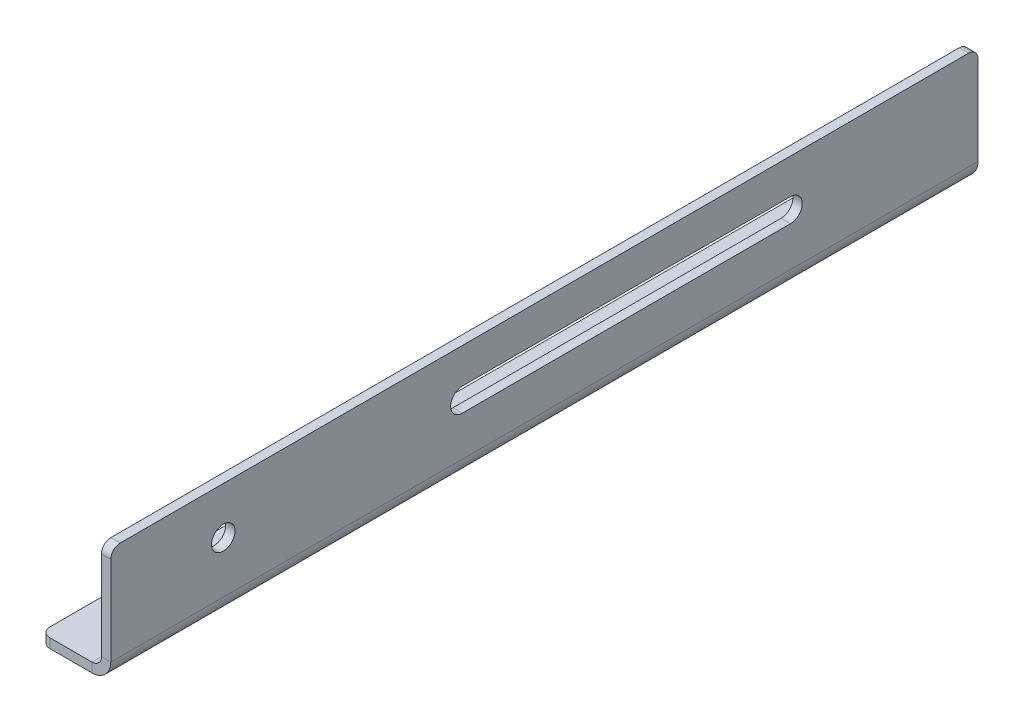
ISO-10303-21;
HEADER;
FILE_DESCRIPTION(('STEP AP214'),'2;1');
FILE_NAME('part.step','',(''),(''),'','','');
FILE_SCHEMA(('AUTOMOTIVE_DESIGN { 1 0 10303 214 1 1 1 1 }'));
ENDSEC;
DATA;
#1=APPLICATION_CONTEXT('core data for automotive mechanical design processes');
#2=APPLICATION_PROTOCOL_DEFINITION('international standard','automotive_design',2000,#1);
#3=PRODUCT_CONTEXT('',#1,'mechanical');
#4=PRODUCT('Part','Part','',(#3));
#5=PRODUCT_RELATED_PRODUCT_CATEGORY('part','',(#4));
#6=PRODUCT_DEFINITION_FORMATION('','',#4);
#7=PRODUCT_DEFINITION_CONTEXT('part definition',#1,'design');
#8=PRODUCT_DEFINITION('design','',#6,#7);
#9=PRODUCT_DEFINITION_SHAPE('','',#8);
#10=(LENGTH_UNIT() NAMED_UNIT(*) SI_UNIT(.MILLI.,.METRE.));
#11=(NAMED_UNIT(*) PLANE_ANGLE_UNIT() SI_UNIT($,.RADIAN.));
#12=(NAMED_UNIT(*) SI_UNIT($,.STERADIAN.) SOLID_ANGLE_UNIT());
#13=UNCERTAINTY_MEASURE_WITH_UNIT(LENGTH_MEASURE(1.E-05),#10,'distance_accuracy_value','');
#14=(GEOMETRIC_REPRESENTATION_CONTEXT(3) GLOBAL_UNCERTAINTY_ASSIGNED_CONTEXT((#13)) GLOBAL_UNIT_ASSIGNED_CONTEXT((#10,
#11,#12)) REPRESENTATION_CONTEXT('',''));
#15=CARTESIAN_POINT('',(0.,0.,0.));
#16=DIRECTION('',(0.,0.,1.));
#17=DIRECTION('',(1.,0.,0.));
#18=AXIS2_PLACEMENT_3D('',#15,#16,#17);
#19=CARTESIAN_POINT('',(0.,4.,0.));
#20=DIRECTION('',(0.,0.,1.));
#21=DIRECTION('',(-1.,0.,0.));
#22=AXIS2_PLACEMENT_3D('',#19,#20,#21);
#23=PLANE('',#22);
#24=DIRECTION('',(1.,0.,0.));
#25=VECTOR('',#24,1.);
#26=CARTESIAN_POINT('',(0.,0.,0.));
#27=LINE('',#26,#25);
#28=CARTESIAN_POINT('',(22.,0.,0.));
#29=VERTEX_POINT('',#28);
#30=CARTESIAN_POINT('',(4.,0.,0.));
#31=VERTEX_POINT('',#30);
#32=EDGE_CURVE('E238',#29,#31,#27,.F.);
#33=ORIENTED_EDGE('',*,*,#32,.T.);
#34=DIRECTION('',(0.,1.,0.));
#35=VECTOR('',#34,1.);
#36=CARTESIAN_POINT('',(4.,4.,0.));
#37=LINE('',#36,#35);
#38=CARTESIAN_POINT('',(4.,4.,0.));
#39=VERTEX_POINT('',#38);
#40=EDGE_CURVE('E277',#31,#39,#37,.T.);
#41=ORIENTED_EDGE('',*,*,#40,.T.);
#42=DIRECTION('',(-1.,0.,0.));
#43=VECTOR('',#42,1.);
#44=CARTESIAN_POINT('',(0.,4.,0.));
#45=LINE('',#44,#43);
#46=CARTESIAN_POINT('',(22.,4.,0.));
#47=VERTEX_POINT('',#46);
#48=EDGE_CURVE('E388',#47,#39,#45,.T.);
#49=ORIENTED_EDGE('',*,*,#48,.F.);
#50=DIRECTION('',(0.,1.,0.));
#51=VECTOR('',#50,1.);
#52=CARTESIAN_POINT('',(22.,4.,0.));
#53=LINE('',#52,#51);
#54=EDGE_CURVE('E258',#29,#47,#53,.T.);
#55=ORIENTED_EDGE('',*,*,#54,.F.);
#56=EDGE_LOOP('',(#33,#41,#49,#55));
#57=FACE_BOUND('',#56,.T.);
#58=ADVANCED_FACE('F37',(#57),#23,.F.);
#59=CARTESIAN_POINT('',(0.,4.,370.));
#60=DIRECTION('',(-1.,0.,0.));
#61=DIRECTION('',(0.,0.,-1.));
#62=AXIS2_PLACEMENT_3D('',#59,#60,#61);
#63=PLANE('',#62);
#64=DIRECTION('',(0.,0.,-1.));
#65=VECTOR('',#64,1.);
#66=CARTESIAN_POINT('',(0.,4.,370.));
#67=LINE('',#66,#65);
#68=CARTESIAN_POINT('',(0.,4.,366.));
#69=VERTEX_POINT('',#68);
#70=CARTESIAN_POINT('',(0.,4.,4.));
#71=VERTEX_POINT('',#70);
#72=EDGE_CURVE('E393',#69,#71,#67,.T.);
#73=ORIENTED_EDGE('',*,*,#72,.T.);
#74=DIRECTION('',(0.,-1.,0.));
#75=VECTOR('',#74,1.);
#76=CARTESIAN_POINT('',(0.,4.,4.));
#77=LINE('',#76,#75);
#78=CARTESIAN_POINT('',(0.,0.,4.));
#79=VERTEX_POINT('',#78);
#80=EDGE_CURVE('E58',#71,#79,#77,.T.);
#81=ORIENTED_EDGE('',*,*,#80,.T.);
#82=DIRECTION('',(0.,0.,-1.));
#83=VECTOR('',#82,1.);
#84=CARTESIAN_POINT('',(0.,0.,370.));
#85=LINE('',#84,#83);
#86=CARTESIAN_POINT('',(0.,0.,366.));
#87=VERTEX_POINT('',#86);
#88=EDGE_CURVE('E236',#87,#79,#85,.T.);
#89=ORIENTED_EDGE('',*,*,#88,.F.);
#90=DIRECTION('',(0.,1.,0.));
#91=VECTOR('',#90,1.);
#92=CARTESIAN_POINT('',(0.,4.,366.));
#93=LINE('',#92,#91);
#94=EDGE_CURVE('E284',#87,#69,#93,.T.);
#95=ORIENTED_EDGE('',*,*,#94,.T.);
#96=EDGE_LOOP('',(#73,#81,#89,#95));
#97=FACE_BOUND('',#96,.T.);
#98=ADVANCED_FACE('F346',(#97),#63,.T.);
#99=CARTESIAN_POINT('',(0.,4.,370.));
#100=DIRECTION('',(0.,0.,1.));
#101=DIRECTION('',(-1.,0.,0.));
#102=AXIS2_PLACEMENT_3D('',#99,#100,#101);
#103=PLANE('',#102);
#104=DIRECTION('',(-1.,0.,0.));
#105=VECTOR('',#104,1.);
#106=CARTESIAN_POINT('',(0.,4.,370.));
#107=LINE('',#106,#105);
#108=CARTESIAN_POINT('',(22.,4.,370.));
#109=VERTEX_POINT('',#108);
#110=CARTESIAN_POINT('',(4.,4.,370.));
#111=VERTEX_POINT('',#110);
#112=EDGE_CURVE('E395',#109,#111,#107,.T.);
#113=ORIENTED_EDGE('',*,*,#112,.T.);
#114=DIRECTION('',(0.,1.,0.));
#115=VECTOR('',#114,1.);
#116=CARTESIAN_POINT('',(4.,4.,370.));
#117=LINE('',#116,#115);
#118=CARTESIAN_POINT('',(4.,0.,370.));
#119=VERTEX_POINT('',#118);
#120=EDGE_CURVE('E11',#111,#119,#117,.F.);
#121=ORIENTED_EDGE('',*,*,#120,.T.);
#122=DIRECTION('',(1.,0.,0.));
#123=VECTOR('',#122,1.);
#124=CARTESIAN_POINT('',(0.,0.,370.));
#125=LINE('',#124,#123);
#126=CARTESIAN_POINT('',(22.,0.,370.));
#127=VERTEX_POINT('',#126);
#128=EDGE_CURVE('E214',#127,#119,#125,.F.);
#129=ORIENTED_EDGE('',*,*,#128,.F.);
#130=DIRECTION('',(0.,1.,0.));
#131=VECTOR('',#130,1.);
#132=CARTESIAN_POINT('',(22.,4.,370.));
#133=LINE('',#132,#131);
#134=EDGE_CURVE('E256',#127,#109,#133,.T.);
#135=ORIENTED_EDGE('',*,*,#134,.T.);
#136=EDGE_LOOP('',(#113,#121,#129,#135));
#137=FACE_BOUND('',#136,.T.);
#138=ADVANCED_FACE('F352',(#137),#103,.T.);
#139=CARTESIAN_POINT('',(22.,8.,370.));
#140=DIRECTION('',(0.,0.,1.));
#141=DIRECTION('',(1.,0.,0.));
#142=AXIS2_PLACEMENT_3D('',#139,#140,#141);
#143=PLANE('',#142);
#144=ORIENTED_EDGE('',*,*,#134,.F.);
#145=CARTESIAN_POINT('',(22.,8.,370.));
#146=DIRECTION('',(0.,0.,1.));
#147=DIRECTION('',(1.,0.,0.));
#148=AXIS2_PLACEMENT_3D('',#145,#146,#147);
#149=CIRCLE('',#148,8.);
#150=CARTESIAN_POINT('',(30.,8.,370.));
#151=VERTEX_POINT('',#150);
#152=EDGE_CURVE('E230',#127,#151,#149,.T.);
#153=ORIENTED_EDGE('',*,*,#152,.T.);
#154=DIRECTION('',(-1.,0.,0.));
#155=VECTOR('',#154,1.);
#156=CARTESIAN_POINT('',(26.,8.,370.));
#157=LINE('',#156,#155);
#158=CARTESIAN_POINT('',(26.,8.,370.));
#159=VERTEX_POINT('',#158);
#160=EDGE_CURVE('E253',#151,#159,#157,.T.);
#161=ORIENTED_EDGE('',*,*,#160,.T.);
#162=CARTESIAN_POINT('',(22.,8.,370.));
#163=DIRECTION('',(0.,0.,-1.));
#164=DIRECTION('',(-1.,0.,0.));
#165=AXIS2_PLACEMENT_3D('',#162,#163,#164);
#166=CIRCLE('',#165,4.);
#167=EDGE_CURVE('E200',#109,#159,#166,.F.);
#168=ORIENTED_EDGE('',*,*,#167,.F.);
#169=EDGE_LOOP('',(#144,#153,#161,#168));
#170=FACE_BOUND('',#169,.T.);
#171=ADVANCED_FACE('F310',(#170),#143,.T.);
#172=CARTESIAN_POINT('',(26.,4.,370.));
#173=DIRECTION('',(0.,0.,1.));
#174=DIRECTION('',(0.,-1.,0.));
#175=AXIS2_PLACEMENT_3D('',#172,#173,#174);
#176=PLANE('',#175);
#177=DIRECTION('',(0.,1.,0.));
#178=VECTOR('',#177,1.);
#179=CARTESIAN_POINT('',(30.,4.,370.));
#180=LINE('',#179,#178);
#181=CARTESIAN_POINT('',(30.,46.,370.));
#182=VERTEX_POINT('',#181);
#183=EDGE_CURVE('E226',#182,#151,#180,.F.);
#184=ORIENTED_EDGE('',*,*,#183,.F.);
#185=DIRECTION('',(1.,0.,0.));
#186=VECTOR('',#185,1.);
#187=CARTESIAN_POINT('',(26.,46.,370.));
#188=LINE('',#187,#186);
#189=CARTESIAN_POINT('',(26.,46.,370.));
#190=VERTEX_POINT('',#189);
#191=EDGE_CURVE('E45',#182,#190,#188,.F.);
#192=ORIENTED_EDGE('',*,*,#191,.T.);
#193=DIRECTION('',(0.,-1.,0.));
#194=VECTOR('',#193,1.);
#195=CARTESIAN_POINT('',(26.,4.,370.));
#196=LINE('',#195,#194);
#197=EDGE_CURVE('E187',#190,#159,#196,.T.);
#198=ORIENTED_EDGE('',*,*,#197,.T.);
#199=ORIENTED_EDGE('',*,*,#160,.F.);
#200=EDGE_LOOP('',(#184,#192,#198,#199));
#201=FACE_BOUND('',#200,.T.);
#202=ADVANCED_FACE('F296',(#201),#176,.T.);
#203=CARTESIAN_POINT('',(26.,50.,370.));
#204=DIRECTION('',(0.,-1.,0.));
#205=DIRECTION('',(0.,0.,-1.));
#206=AXIS2_PLACEMENT_3D('',#203,#204,#205);
#207=PLANE('',#206);
#208=DIRECTION('',(0.,0.,-1.));
#209=VECTOR('',#208,1.);
#210=CARTESIAN_POINT('',(30.,50.,370.));
#211=LINE('',#210,#209);
#212=CARTESIAN_POINT('',(30.,50.,366.));
#213=VERTEX_POINT('',#212);
#214=CARTESIAN_POINT('',(30.,50.,4.));
#215=VERTEX_POINT('',#214);
#216=EDGE_CURVE('E210',#213,#215,#211,.T.);
#217=ORIENTED_EDGE('',*,*,#216,.T.);
#218=DIRECTION('',(1.,0.,0.));
#219=VECTOR('',#218,1.);
#220=CARTESIAN_POINT('',(26.,50.,4.));
#221=LINE('',#220,#219);
#222=CARTESIAN_POINT('',(26.,50.,4.));
#223=VERTEX_POINT('',#222);
#224=EDGE_CURVE('E264',#215,#223,#221,.F.);
#225=ORIENTED_EDGE('',*,*,#224,.T.);
#226=DIRECTION('',(0.,0.,-1.));
#227=VECTOR('',#226,1.);
#228=CARTESIAN_POINT('',(26.,50.,370.));
#229=LINE('',#228,#227);
#230=CARTESIAN_POINT('',(26.,50.,366.));
#231=VERTEX_POINT('',#230);
#232=EDGE_CURVE('E189',#231,#223,#229,.T.);
#233=ORIENTED_EDGE('',*,*,#232,.F.);
#234=DIRECTION('',(-1.,0.,0.));
#235=VECTOR('',#234,1.);
#236=CARTESIAN_POINT('',(26.,50.,366.));
#237=LINE('',#236,#235);
#238=EDGE_CURVE('E260',#231,#213,#237,.F.);
#239=ORIENTED_EDGE('',*,*,#238,.T.);
#240=EDGE_LOOP('',(#217,#225,#233,#239));
#241=FACE_BOUND('',#240,.T.);
#242=ADVANCED_FACE('F325',(#241),#207,.F.);
#243=CARTESIAN_POINT('',(26.,4.,0.));
#244=DIRECTION('',(0.,0.,1.));
#245=DIRECTION('',(0.,-1.,0.));
#246=AXIS2_PLACEMENT_3D('',#243,#244,#245);
#247=PLANE('',#246);
#248=DIRECTION('',(0.,-1.,0.));
#249=VECTOR('',#248,1.);
#250=CARTESIAN_POINT('',(26.,4.,0.));
#251=LINE('',#250,#249);
#252=CARTESIAN_POINT('',(26.,46.,0.));
#253=VERTEX_POINT('',#252);
#254=CARTESIAN_POINT('',(26.,8.,0.));
#255=VERTEX_POINT('',#254);
#256=EDGE_CURVE('E185',#253,#255,#251,.T.);
#257=ORIENTED_EDGE('',*,*,#256,.F.);
#258=DIRECTION('',(1.,0.,0.));
#259=VECTOR('',#258,1.);
#260=CARTESIAN_POINT('',(26.,46.,0.));
#261=LINE('',#260,#259);
#262=CARTESIAN_POINT('',(30.,46.,0.));
#263=VERTEX_POINT('',#262);
#264=EDGE_CURVE('E271',#253,#263,#261,.T.);
#265=ORIENTED_EDGE('',*,*,#264,.T.);
#266=DIRECTION('',(0.,1.,0.));
#267=VECTOR('',#266,1.);
#268=CARTESIAN_POINT('',(30.,4.,0.));
#269=LINE('',#268,#267);
#270=CARTESIAN_POINT('',(30.,8.,0.));
#271=VERTEX_POINT('',#270);
#272=EDGE_CURVE('E220',#263,#271,#269,.F.);
#273=ORIENTED_EDGE('',*,*,#272,.T.);
#274=DIRECTION('',(-1.,0.,0.));
#275=VECTOR('',#274,1.);
#276=CARTESIAN_POINT('',(26.,8.,0.));
#277=LINE('',#276,#275);
#278=EDGE_CURVE('E251',#271,#255,#277,.T.);
#279=ORIENTED_EDGE('',*,*,#278,.T.);
#280=EDGE_LOOP('',(#257,#265,#273,#279));
#281=FACE_BOUND('',#280,.T.);
#282=ADVANCED_FACE('F330',(#281),#247,.F.);
#283=CARTESIAN_POINT('',(26.,35.,80.));
#284=DIRECTION('',(0.,-1.,0.));
#285=DIRECTION('',(0.,0.,-1.));
#286=AXIS2_PLACEMENT_3D('',#283,#284,#285);
#287=PLANE('',#286);
#288=DIRECTION('',(-1.,0.,0.));
#289=VECTOR('',#288,1.);
#290=CARTESIAN_POINT('',(26.,35.,80.));
#291=LINE('',#290,#289);
#292=CARTESIAN_POINT('',(30.,35.,80.));
#293=VERTEX_POINT('',#292);
#294=CARTESIAN_POINT('',(26.,35.,80.));
#295=VERTEX_POINT('',#294);
#296=EDGE_CURVE('E178',#293,#295,#291,.T.);
#297=ORIENTED_EDGE('',*,*,#296,.F.);
#298=DIRECTION('',(0.,0.,-1.));
#299=VECTOR('',#298,1.);
#300=CARTESIAN_POINT('',(30.,35.,370.));
#301=LINE('',#300,#299);
#302=CARTESIAN_POINT('',(30.,35.,220.));
#303=VERTEX_POINT('',#302);
#304=EDGE_CURVE('E221',#303,#293,#301,.T.);
#305=ORIENTED_EDGE('',*,*,#304,.F.);
#306=DIRECTION('',(-1.,0.,0.));
#307=VECTOR('',#306,1.);
#308=CARTESIAN_POINT('',(26.,35.,220.));
#309=LINE('',#308,#307);
#310=CARTESIAN_POINT('',(26.,35.,220.));
#311=VERTEX_POINT('',#310);
#312=EDGE_CURVE('E249',#303,#311,#309,.T.);
#313=ORIENTED_EDGE('',*,*,#312,.T.);
#314=DIRECTION('',(0.,0.,-1.));
#315=VECTOR('',#314,1.);
#316=CARTESIAN_POINT('',(26.,35.,80.));
#317=LINE('',#316,#315);
#318=EDGE_CURVE('E179',#311,#295,#317,.T.);
#319=ORIENTED_EDGE('',*,*,#318,.T.);
#320=EDGE_LOOP('',(#297,#305,#313,#319));
#321=FACE_BOUND('',#320,.T.);
#322=ADVANCED_FACE('F414',(#321),#287,.T.);
#323=CARTESIAN_POINT('',(26.,30.,220.));
#324=DIRECTION('',(1.,0.,0.));
#325=DIRECTION('',(0.,0.,-1.));
#326=AXIS2_PLACEMENT_3D('',#323,#324,#325);
#327=CYLINDRICAL_SURFACE('',#326,5.);
#328=ORIENTED_EDGE('',*,*,#312,.F.);
#329=CARTESIAN_POINT('',(30.,30.,220.));
#330=DIRECTION('',(-1.,0.,0.));
#331=DIRECTION('',(0.,0.,1.));
#332=AXIS2_PLACEMENT_3D('',#329,#330,#331);
#333=CIRCLE('',#332,5.);
#334=CARTESIAN_POINT('',(30.,25.,220.));
#335=VERTEX_POINT('',#334);
#336=EDGE_CURVE('E217',#335,#303,#333,.T.);
#337=ORIENTED_EDGE('',*,*,#336,.F.);
#338=DIRECTION('',(-1.,0.,0.));
#339=VECTOR('',#338,1.);
#340=CARTESIAN_POINT('',(26.,25.,220.));
#341=LINE('',#340,#339);
#342=CARTESIAN_POINT('',(26.,25.,220.));
#343=VERTEX_POINT('',#342);
#344=EDGE_CURVE('E163',#335,#343,#341,.T.);
#345=ORIENTED_EDGE('',*,*,#344,.T.);
#346=CARTESIAN_POINT('',(26.,30.,220.));
#347=DIRECTION('',(-1.,0.,0.));
#348=DIRECTION('',(0.,0.,1.));
#349=AXIS2_PLACEMENT_3D('',#346,#347,#348);
#350=CIRCLE('',#349,5.);
#351=EDGE_CURVE('E174',#343,#311,#350,.T.);
#352=ORIENTED_EDGE('',*,*,#351,.T.);
#353=EDGE_LOOP('',(#328,#337,#345,#352));
#354=FACE_BOUND('',#353,.T.);
#355=ADVANCED_FACE('F411',(#354),#327,.F.);
#356=CARTESIAN_POINT('',(26.,25.,80.));
#357=DIRECTION('',(0.,1.,0.));
#358=DIRECTION('',(0.,0.,1.));
#359=AXIS2_PLACEMENT_3D('',#356,#357,#358);
#360=PLANE('',#359);
#361=ORIENTED_EDGE('',*,*,#344,.F.);
#362=DIRECTION('',(0.,0.,-1.));
#363=VECTOR('',#362,1.);
#364=CARTESIAN_POINT('',(30.,25.,370.));
#365=LINE('',#364,#363);
#366=CARTESIAN_POINT('',(30.,25.,80.));
#367=VERTEX_POINT('',#366);
#368=EDGE_CURVE('E158',#367,#335,#365,.F.);
#369=ORIENTED_EDGE('',*,*,#368,.F.);
#370=DIRECTION('',(-1.,0.,0.));
#371=VECTOR('',#370,1.);
#372=CARTESIAN_POINT('',(26.,25.,80.));
#373=LINE('',#372,#371);
#374=CARTESIAN_POINT('',(26.,25.,80.));
#375=VERTEX_POINT('',#374);
#376=EDGE_CURVE('E152',#367,#375,#373,.T.);
#377=ORIENTED_EDGE('',*,*,#376,.T.);
#378=DIRECTION('',(0.,0.,1.));
#379=VECTOR('',#378,1.);
#380=CARTESIAN_POINT('',(26.,25.,80.));
#381=LINE('',#380,#379);
#382=EDGE_CURVE('E155',#375,#343,#381,.T.);
#383=ORIENTED_EDGE('',*,*,#382,.T.);
#384=EDGE_LOOP('',(#361,#369,#377,#383));
#385=FACE_BOUND('',#384,.T.);
#386=ADVANCED_FACE('F154',(#385),#360,.T.);
#387=CARTESIAN_POINT('',(8.2,4.,27.7));
#388=DIRECTION('',(0.,-1.,0.));
#389=DIRECTION('',(0.,0.,-1.));
#390=AXIS2_PLACEMENT_3D('',#387,#388,#389);
#391=CYLINDRICAL_SURFACE('',#390,2.5);
#392=CARTESIAN_POINT('',(8.2,4.,27.7));
#393=DIRECTION('',(0.,-1.,0.));
#394=DIRECTION('',(0.,0.,-1.));
#395=AXIS2_PLACEMENT_3D('',#392,#393,#394);
#396=CIRCLE('',#395,2.5);
#397=CARTESIAN_POINT('',(8.2,4.,25.2));
#398=VERTEX_POINT('',#397);
#399=EDGE_CURVE('E204',#398,#398,#396,.T.);
#400=ORIENTED_EDGE('',*,*,#399,.F.);
#401=EDGE_LOOP('',(#400));
#402=FACE_BOUND('',#401,.T.);
#403=CARTESIAN_POINT('',(8.2,0.,27.7));
#404=DIRECTION('',(0.,-1.,0.));
#405=DIRECTION('',(0.,0.,-1.));
#406=AXIS2_PLACEMENT_3D('',#403,#404,#405);
#407=CIRCLE('',#406,2.5);
#408=CARTESIAN_POINT('',(8.2,0.,25.2));
#409=VERTEX_POINT('',#408);
#410=EDGE_CURVE('E233',#409,#409,#407,.T.);
#411=ORIENTED_EDGE('',*,*,#410,.T.);
#412=EDGE_LOOP('',(#411));
#413=FACE_BOUND('',#412,.T.);
#414=ADVANCED_FACE('F360',(#402,#413),#391,.F.);
#415=CARTESIAN_POINT('',(8.2,4.,342.3));
#416=DIRECTION('',(0.,-1.,0.));
#417=DIRECTION('',(0.,0.,-1.));
#418=AXIS2_PLACEMENT_3D('',#415,#416,#417);
#419=CYLINDRICAL_SURFACE('',#418,2.5);
#420=CARTESIAN_POINT('',(8.2,4.,342.3));
#421=DIRECTION('',(0.,-1.,0.));
#422=DIRECTION('',(0.,0.,-1.));
#423=AXIS2_PLACEMENT_3D('',#420,#421,#422);
#424=CIRCLE('',#423,2.5);
#425=CARTESIAN_POINT('',(8.2,4.,339.8));
#426=VERTEX_POINT('',#425);
#427=EDGE_CURVE('E375',#426,#426,#424,.T.);
#428=ORIENTED_EDGE('',*,*,#427,.F.);
#429=EDGE_LOOP('',(#428));
#430=FACE_BOUND('',#429,.T.);
#431=CARTESIAN_POINT('',(8.2,0.,342.3));
#432=DIRECTION('',(0.,-1.,0.));
#433=DIRECTION('',(0.,0.,-1.));
#434=AXIS2_PLACEMENT_3D('',#431,#432,#433);
#435=CIRCLE('',#434,2.5);
#436=CARTESIAN_POINT('',(8.2,0.,339.8));
#437=VERTEX_POINT('',#436);
#438=EDGE_CURVE('E241',#437,#437,#435,.T.);
#439=ORIENTED_EDGE('',*,*,#438,.T.);
#440=EDGE_LOOP('',(#439));
#441=FACE_BOUND('',#440,.T.);
#442=ADVANCED_FACE('F362',(#430,#441),#419,.F.);
#443=CARTESIAN_POINT('',(26.,30.,322.));
#444=DIRECTION('',(1.,0.,0.));
#445=DIRECTION('',(0.,0.,-1.));
#446=AXIS2_PLACEMENT_3D('',#443,#444,#445);
#447=CYLINDRICAL_SURFACE('',#446,4.99999999999999);
#448=CARTESIAN_POINT('',(26.,30.,322.));
#449=DIRECTION('',(1.,0.,0.));
#450=DIRECTION('',(0.,0.,-1.));
#451=AXIS2_PLACEMENT_3D('',#448,#449,#450);
#452=CIRCLE('',#451,4.99999999999999);
#453=CARTESIAN_POINT('',(26.,30.,317.));
#454=VERTEX_POINT('',#453);
#455=EDGE_CURVE('E175',#454,#454,#452,.T.);
#456=ORIENTED_EDGE('',*,*,#455,.F.);
#457=EDGE_LOOP('',(#456));
#458=FACE_BOUND('',#457,.T.);
#459=CARTESIAN_POINT('',(30.,30.,322.));
#460=DIRECTION('',(1.,0.,0.));
#461=DIRECTION('',(0.,0.,-1.));
#462=AXIS2_PLACEMENT_3D('',#459,#460,#461);
#463=CIRCLE('',#462,4.99999999999999);
#464=CARTESIAN_POINT('',(30.,30.,317.));
#465=VERTEX_POINT('',#464);
#466=EDGE_CURVE('E211',#465,#465,#463,.T.);
#467=ORIENTED_EDGE('',*,*,#466,.T.);
#468=EDGE_LOOP('',(#467));
#469=FACE_BOUND('',#468,.T.);
#470=ADVANCED_FACE('F365',(#458,#469),#447,.F.);
#471=CARTESIAN_POINT('',(26.,30.,80.));
#472=DIRECTION('',(1.,0.,0.));
#473=DIRECTION('',(0.,0.,-1.));
#474=AXIS2_PLACEMENT_3D('',#471,#472,#473);
#475=CYLINDRICAL_SURFACE('',#474,5.);
#476=CARTESIAN_POINT('',(30.,30.,80.));
#477=DIRECTION('',(-1.,0.,0.));
#478=DIRECTION('',(0.,0.,1.));
#479=AXIS2_PLACEMENT_3D('',#476,#477,#478);
#480=CIRCLE('',#479,5.);
#481=EDGE_CURVE('E216',#293,#367,#480,.T.);
#482=ORIENTED_EDGE('',*,*,#481,.F.);
#483=ORIENTED_EDGE('',*,*,#296,.T.);
#484=CARTESIAN_POINT('',(26.,30.,80.));
#485=DIRECTION('',(-1.,0.,0.));
#486=DIRECTION('',(0.,0.,1.));
#487=AXIS2_PLACEMENT_3D('',#484,#485,#486);
#488=CIRCLE('',#487,5.);
#489=EDGE_CURVE('E171',#295,#375,#488,.T.);
#490=ORIENTED_EDGE('',*,*,#489,.T.);
#491=ORIENTED_EDGE('',*,*,#376,.F.);
#492=EDGE_LOOP('',(#482,#483,#490,#491));
#493=FACE_BOUND('',#492,.T.);
#494=ADVANCED_FACE('F177',(#493),#475,.F.);
#495=CARTESIAN_POINT('',(22.,8.,0.));
#496=DIRECTION('',(0.,0.,-1.));
#497=DIRECTION('',(-1.,0.,0.));
#498=AXIS2_PLACEMENT_3D('',#495,#496,#497);
#499=PLANE('',#498);
#500=CARTESIAN_POINT('',(22.,8.,0.));
#501=DIRECTION('',(0.,0.,1.));
#502=DIRECTION('',(1.,0.,0.));
#503=AXIS2_PLACEMENT_3D('',#500,#501,#502);
#504=CIRCLE('',#503,8.);
#505=EDGE_CURVE('E234',#271,#29,#504,.F.);
#506=ORIENTED_EDGE('',*,*,#505,.T.);
#507=ORIENTED_EDGE('',*,*,#54,.T.);
#508=CARTESIAN_POINT('',(22.,8.,0.));
#509=DIRECTION('',(0.,0.,1.));
#510=DIRECTION('',(1.,0.,0.));
#511=AXIS2_PLACEMENT_3D('',#508,#509,#510);
#512=CIRCLE('',#511,4.);
#513=EDGE_CURVE('E197',#255,#47,#512,.F.);
#514=ORIENTED_EDGE('',*,*,#513,.F.);
#515=ORIENTED_EDGE('',*,*,#278,.F.);
#516=EDGE_LOOP('',(#506,#507,#514,#515));
#517=FACE_BOUND('',#516,.T.);
#518=ADVANCED_FACE('F356',(#517),#499,.T.);
#519=CARTESIAN_POINT('',(26.,4.,370.));
#520=DIRECTION('',(1.,0.,0.));
#521=DIRECTION('',(0.,0.,-1.));
#522=AXIS2_PLACEMENT_3D('',#519,#520,#521);
#523=PLANE('',#522);
#524=ORIENTED_EDGE('',*,*,#455,.T.);
#525=EDGE_LOOP('',(#524));
#526=FACE_BOUND('',#525,.T.);
#527=ORIENTED_EDGE('',*,*,#382,.F.);
#528=ORIENTED_EDGE('',*,*,#489,.F.);
#529=ORIENTED_EDGE('',*,*,#318,.F.);
#530=ORIENTED_EDGE('',*,*,#351,.F.);
#531=EDGE_LOOP('',(#527,#528,#529,#530));
#532=FACE_BOUND('',#531,.T.);
#533=ORIENTED_EDGE('',*,*,#232,.T.);
#534=CARTESIAN_POINT('',(26.,46.,4.));
#535=DIRECTION('',(1.,0.,0.));
#536=DIRECTION('',(0.,0.,-1.));
#537=AXIS2_PLACEMENT_3D('',#534,#535,#536);
#538=CIRCLE('',#537,4.);
#539=EDGE_CURVE('E269',#223,#253,#538,.F.);
#540=ORIENTED_EDGE('',*,*,#539,.T.);
#541=ORIENTED_EDGE('',*,*,#256,.T.);
#542=DIRECTION('',(0.,0.,-1.));
#543=VECTOR('',#542,1.);
#544=CARTESIAN_POINT('',(26.,8.,370.));
#545=LINE('',#544,#543);
#546=EDGE_CURVE('E164',#255,#159,#545,.F.);
#547=ORIENTED_EDGE('',*,*,#546,.T.);
#548=ORIENTED_EDGE('',*,*,#197,.F.);
#549=CARTESIAN_POINT('',(26.,46.,366.));
#550=DIRECTION('',(1.,0.,0.));
#551=DIRECTION('',(0.,0.,-1.));
#552=AXIS2_PLACEMENT_3D('',#549,#550,#551);
#553=CIRCLE('',#552,4.);
#554=EDGE_CURVE('E267',#190,#231,#553,.F.);
#555=ORIENTED_EDGE('',*,*,#554,.T.);
#556=EDGE_LOOP('',(#533,#540,#541,#547,#548,#555));
#557=FACE_BOUND('',#556,.T.);
#558=ADVANCED_FACE('F168',(#526,#532,#557),#523,.F.);
#559=CARTESIAN_POINT('',(0.,4.,370.));
#560=DIRECTION('',(0.,-1.,0.));
#561=DIRECTION('',(0.,0.,-1.));
#562=AXIS2_PLACEMENT_3D('',#559,#560,#561);
#563=PLANE('',#562);
#564=ORIENTED_EDGE('',*,*,#399,.T.);
#565=EDGE_LOOP('',(#564));
#566=FACE_BOUND('',#565,.T.);
#567=ORIENTED_EDGE('',*,*,#427,.T.);
#568=EDGE_LOOP('',(#567));
#569=FACE_BOUND('',#568,.T.);
#570=ORIENTED_EDGE('',*,*,#48,.T.);
#571=CARTESIAN_POINT('',(4.,4.,4.));
#572=DIRECTION('',(0.,-1.,0.));
#573=DIRECTION('',(0.,0.,-1.));
#574=AXIS2_PLACEMENT_3D('',#571,#572,#573);
#575=CIRCLE('',#574,4.);
#576=EDGE_CURVE('E282',#39,#71,#575,.F.);
#577=ORIENTED_EDGE('',*,*,#576,.T.);
#578=ORIENTED_EDGE('',*,*,#72,.F.);
#579=CARTESIAN_POINT('',(4.,4.,366.));
#580=DIRECTION('',(0.,-1.,0.));
#581=DIRECTION('',(0.,0.,-1.));
#582=AXIS2_PLACEMENT_3D('',#579,#580,#581);
#583=CIRCLE('',#582,4.);
#584=EDGE_CURVE('E280',#69,#111,#583,.F.);
#585=ORIENTED_EDGE('',*,*,#584,.T.);
#586=ORIENTED_EDGE('',*,*,#112,.F.);
#587=DIRECTION('',(0.,0.,-1.));
#588=VECTOR('',#587,1.);
#589=CARTESIAN_POINT('',(22.,4.,0.));
#590=LINE('',#589,#588);
#591=EDGE_CURVE('E192',#109,#47,#590,.T.);
#592=ORIENTED_EDGE('',*,*,#591,.T.);
#593=EDGE_LOOP('',(#570,#577,#578,#585,#586,#592));
#594=FACE_BOUND('',#593,.T.);
#595=ADVANCED_FACE('F390',(#566,#569,#594),#563,.F.);
#596=CARTESIAN_POINT('',(22.,8.,370.));
#597=DIRECTION('',(0.,0.,1.));
#598=DIRECTION('',(1.,0.,0.));
#599=AXIS2_PLACEMENT_3D('',#596,#597,#598);
#600=CYLINDRICAL_SURFACE('',#599,4.);
#601=ORIENTED_EDGE('',*,*,#167,.T.);
#602=ORIENTED_EDGE('',*,*,#546,.F.);
#603=ORIENTED_EDGE('',*,*,#513,.T.);
#604=ORIENTED_EDGE('',*,*,#591,.F.);
#605=EDGE_LOOP('',(#601,#602,#603,#604));
#606=FACE_BOUND('',#605,.T.);
#607=ADVANCED_FACE('F304',(#606),#600,.F.);
#608=CARTESIAN_POINT('',(30.,4.,370.));
#609=DIRECTION('',(1.,0.,0.));
#610=DIRECTION('',(0.,0.,-1.));
#611=AXIS2_PLACEMENT_3D('',#608,#609,#610);
#612=PLANE('',#611);
#613=ORIENTED_EDGE('',*,*,#466,.F.);
#614=EDGE_LOOP('',(#613));
#615=FACE_BOUND('',#614,.T.);
#616=ORIENTED_EDGE('',*,*,#368,.T.);
#617=ORIENTED_EDGE('',*,*,#336,.T.);
#618=ORIENTED_EDGE('',*,*,#304,.T.);
#619=ORIENTED_EDGE('',*,*,#481,.T.);
#620=EDGE_LOOP('',(#616,#617,#618,#619));
#621=FACE_BOUND('',#620,.T.);
#622=ORIENTED_EDGE('',*,*,#272,.F.);
#623=CARTESIAN_POINT('',(30.,46.,4.));
#624=DIRECTION('',(1.,0.,0.));
#625=DIRECTION('',(0.,0.,-1.));
#626=AXIS2_PLACEMENT_3D('',#623,#624,#625);
#627=CIRCLE('',#626,4.);
#628=EDGE_CURVE('E275',#263,#215,#627,.T.);
#629=ORIENTED_EDGE('',*,*,#628,.T.);
#630=ORIENTED_EDGE('',*,*,#216,.F.);
#631=CARTESIAN_POINT('',(30.,46.,366.));
#632=DIRECTION('',(1.,0.,0.));
#633=DIRECTION('',(0.,0.,-1.));
#634=AXIS2_PLACEMENT_3D('',#631,#632,#633);
#635=CIRCLE('',#634,4.);
#636=EDGE_CURVE('E273',#213,#182,#635,.T.);
#637=ORIENTED_EDGE('',*,*,#636,.T.);
#638=ORIENTED_EDGE('',*,*,#183,.T.);
#639=DIRECTION('',(0.,0.,-1.));
#640=VECTOR('',#639,1.);
#641=CARTESIAN_POINT('',(30.,8.,370.));
#642=LINE('',#641,#640);
#643=EDGE_CURVE('E201',#271,#151,#642,.F.);
#644=ORIENTED_EDGE('',*,*,#643,.F.);
#645=EDGE_LOOP('',(#622,#629,#630,#637,#638,#644));
#646=FACE_BOUND('',#645,.T.);
#647=ADVANCED_FACE('F319',(#615,#621,#646),#612,.T.);
#648=CARTESIAN_POINT('',(0.,0.,370.));
#649=DIRECTION('',(0.,-1.,0.));
#650=DIRECTION('',(0.,0.,-1.));
#651=AXIS2_PLACEMENT_3D('',#648,#649,#650);
#652=PLANE('',#651);
#653=ORIENTED_EDGE('',*,*,#410,.F.);
#654=EDGE_LOOP('',(#653));
#655=FACE_BOUND('',#654,.T.);
#656=ORIENTED_EDGE('',*,*,#438,.F.);
#657=EDGE_LOOP('',(#656));
#658=FACE_BOUND('',#657,.T.);
#659=ORIENTED_EDGE('',*,*,#88,.T.);
#660=CARTESIAN_POINT('',(4.,0.,4.));
#661=DIRECTION('',(0.,-1.,0.));
#662=DIRECTION('',(0.,0.,-1.));
#663=AXIS2_PLACEMENT_3D('',#660,#661,#662);
#664=CIRCLE('',#663,4.);
#665=EDGE_CURVE('E290',#79,#31,#664,.T.);
#666=ORIENTED_EDGE('',*,*,#665,.T.);
#667=ORIENTED_EDGE('',*,*,#32,.F.);
#668=DIRECTION('',(0.,0.,-1.));
#669=VECTOR('',#668,1.);
#670=CARTESIAN_POINT('',(22.,0.,370.));
#671=LINE('',#670,#669);
#672=EDGE_CURVE('E207',#127,#29,#671,.T.);
#673=ORIENTED_EDGE('',*,*,#672,.F.);
#674=ORIENTED_EDGE('',*,*,#128,.T.);
#675=CARTESIAN_POINT('',(4.,0.,366.));
#676=DIRECTION('',(0.,-1.,0.));
#677=DIRECTION('',(0.,0.,-1.));
#678=AXIS2_PLACEMENT_3D('',#675,#676,#677);
#679=CIRCLE('',#678,4.);
#680=EDGE_CURVE('E288',#119,#87,#679,.T.);
#681=ORIENTED_EDGE('',*,*,#680,.T.);
#682=EDGE_LOOP('',(#659,#666,#667,#673,#674,#681));
#683=FACE_BOUND('',#682,.T.);
#684=ADVANCED_FACE('F342',(#655,#658,#683),#652,.T.);
#685=CARTESIAN_POINT('',(22.,8.,370.));
#686=DIRECTION('',(0.,0.,1.));
#687=DIRECTION('',(1.,0.,0.));
#688=AXIS2_PLACEMENT_3D('',#685,#686,#687);
#689=CYLINDRICAL_SURFACE('',#688,8.);
#690=ORIENTED_EDGE('',*,*,#152,.F.);
#691=ORIENTED_EDGE('',*,*,#672,.T.);
#692=ORIENTED_EDGE('',*,*,#505,.F.);
#693=ORIENTED_EDGE('',*,*,#643,.T.);
#694=EDGE_LOOP('',(#690,#691,#692,#693));
#695=FACE_BOUND('',#694,.T.);
#696=ADVANCED_FACE('F316',(#695),#689,.T.);
#697=CARTESIAN_POINT('',(26.,46.,4.));
#698=DIRECTION('',(-1.,0.,0.));
#699=DIRECTION('',(0.,0.,1.));
#700=AXIS2_PLACEMENT_3D('',#697,#698,#699);
#701=CYLINDRICAL_SURFACE('',#700,4.);
#702=ORIENTED_EDGE('',*,*,#628,.F.);
#703=ORIENTED_EDGE('',*,*,#264,.F.);
#704=ORIENTED_EDGE('',*,*,#539,.F.);
#705=ORIENTED_EDGE('',*,*,#224,.F.);
#706=EDGE_LOOP('',(#702,#703,#704,#705));
#707=FACE_BOUND('',#706,.T.);
#708=ADVANCED_FACE('F332',(#707),#701,.T.);
#709=CARTESIAN_POINT('',(4.,4.,4.));
#710=DIRECTION('',(0.,-1.,0.));
#711=DIRECTION('',(0.,0.,-1.));
#712=AXIS2_PLACEMENT_3D('',#709,#710,#711);
#713=CYLINDRICAL_SURFACE('',#712,4.);
#714=ORIENTED_EDGE('',*,*,#665,.F.);
#715=ORIENTED_EDGE('',*,*,#80,.F.);
#716=ORIENTED_EDGE('',*,*,#576,.F.);
#717=ORIENTED_EDGE('',*,*,#40,.F.);
#718=EDGE_LOOP('',(#714,#715,#716,#717));
#719=FACE_BOUND('',#718,.T.);
#720=ADVANCED_FACE('F334',(#719),#713,.T.);
#721=CARTESIAN_POINT('',(26.,46.,366.));
#722=DIRECTION('',(1.,0.,0.));
#723=DIRECTION('',(0.,0.,-1.));
#724=AXIS2_PLACEMENT_3D('',#721,#722,#723);
#725=CYLINDRICAL_SURFACE('',#724,4.);
#726=ORIENTED_EDGE('',*,*,#636,.F.);
#727=ORIENTED_EDGE('',*,*,#238,.F.);
#728=ORIENTED_EDGE('',*,*,#554,.F.);
#729=ORIENTED_EDGE('',*,*,#191,.F.);
#730=EDGE_LOOP('',(#726,#727,#728,#729));
#731=FACE_BOUND('',#730,.T.);
#732=ADVANCED_FACE('F323',(#731),#725,.T.);
#733=CARTESIAN_POINT('',(4.,4.,366.));
#734=DIRECTION('',(0.,1.,0.));
#735=DIRECTION('',(0.,0.,1.));
#736=AXIS2_PLACEMENT_3D('',#733,#734,#735);
#737=CYLINDRICAL_SURFACE('',#736,4.);
#738=ORIENTED_EDGE('',*,*,#680,.F.);
#739=ORIENTED_EDGE('',*,*,#120,.F.);
#740=ORIENTED_EDGE('',*,*,#584,.F.);
#741=ORIENTED_EDGE('',*,*,#94,.F.);
#742=EDGE_LOOP('',(#738,#739,#740,#741));
#743=FACE_BOUND('',#742,.T.);
#744=ADVANCED_FACE('F39',(#743),#737,.T.);
#745=CLOSED_SHELL('',(#58,#98,#138,#171,#202,#242,#282,#322,#355,#386,#414,#442,#470,#494,#518,
#558,#595,#607,#647,#684,#696,#708,#720,#732,#744));
#746=MANIFOLD_SOLID_BREP('B2',#745);
#747=ADVANCED_BREP_SHAPE_REPRESENTATION('',(#18,#746),#14);
#748=SHAPE_DEFINITION_REPRESENTATION(#9,#747);
ENDSEC;
END-ISO-10303-21;
